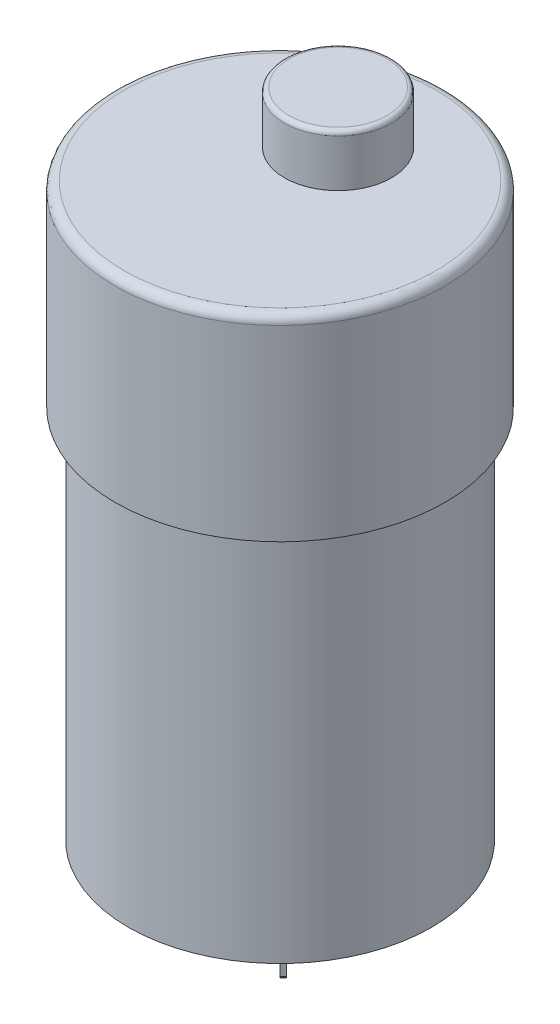
ISO-10303-21;
HEADER;
FILE_DESCRIPTION(('STEP AP214'),'2;1');
FILE_NAME('part.step','',(''),(''),'','','');
FILE_SCHEMA(('AUTOMOTIVE_DESIGN { 1 0 10303 214 1 1 1 1 }'));
ENDSEC;
DATA;
#1=APPLICATION_CONTEXT('core data for automotive mechanical design processes');
#2=APPLICATION_PROTOCOL_DEFINITION('international standard','automotive_design',2000,#1);
#3=PRODUCT_CONTEXT('',#1,'mechanical');
#4=PRODUCT('Part','Part','',(#3));
#5=PRODUCT_RELATED_PRODUCT_CATEGORY('part','',(#4));
#6=PRODUCT_DEFINITION_FORMATION('','',#4);
#7=PRODUCT_DEFINITION_CONTEXT('part definition',#1,'design');
#8=PRODUCT_DEFINITION('design','',#6,#7);
#9=PRODUCT_DEFINITION_SHAPE('','',#8);
#10=(LENGTH_UNIT() NAMED_UNIT(*) SI_UNIT(.MILLI.,.METRE.));
#11=(NAMED_UNIT(*) PLANE_ANGLE_UNIT() SI_UNIT($,.RADIAN.));
#12=(NAMED_UNIT(*) SI_UNIT($,.STERADIAN.) SOLID_ANGLE_UNIT());
#13=UNCERTAINTY_MEASURE_WITH_UNIT(LENGTH_MEASURE(1.E-05),#10,'distance_accuracy_value','');
#14=(GEOMETRIC_REPRESENTATION_CONTEXT(3) GLOBAL_UNCERTAINTY_ASSIGNED_CONTEXT((#13)) GLOBAL_UNIT_ASSIGNED_CONTEXT((#10,
#11,#12)) REPRESENTATION_CONTEXT('',''));
#15=CARTESIAN_POINT('',(0.,0.,0.));
#16=DIRECTION('',(0.,0.,1.));
#17=DIRECTION('',(1.,0.,0.));
#18=AXIS2_PLACEMENT_3D('',#15,#16,#17);
#19=CARTESIAN_POINT('',(0.,-44.5,0.));
#20=DIRECTION('',(0.,-1.,0.));
#21=DIRECTION('',(0.,0.,-1.));
#22=AXIS2_PLACEMENT_3D('',#19,#20,#21);
#23=PLANE('',#22);
#24=CARTESIAN_POINT('',(0.,-44.4999999999709,0.));
#25=DIRECTION('',(0.,1.,0.));
#26=DIRECTION('',(0.,0.,1.));
#27=AXIS2_PLACEMENT_3D('',#24,#25,#26);
#28=CIRCLE('',#27,1.99999999995271);
#29=CARTESIAN_POINT('',(0.,-44.4999999999709,1.99999999995271));
#30=VERTEX_POINT('',#29);
#31=EDGE_CURVE('E20',#30,#30,#28,.T.);
#32=ORIENTED_EDGE('',*,*,#31,.F.);
#33=EDGE_LOOP('',(#32));
#34=FACE_BOUND('',#33,.T.);
#35=ADVANCED_FACE('F17',(#34),#23,.T.);
#36=CARTESIAN_POINT('',(0.,27.8,0.));
#37=DIRECTION('',(0.,1.,0.));
#38=DIRECTION('',(0.,0.,1.));
#39=AXIS2_PLACEMENT_3D('',#36,#37,#38);
#40=PLANE('',#39);
#41=CARTESIAN_POINT('',(0.,27.8,-6.5));
#42=DIRECTION('',(0.,-1.,0.));
#43=DIRECTION('',(1.,0.,0.));
#44=AXIS2_PLACEMENT_3D('',#41,#42,#43);
#45=CIRCLE('',#44,5.5);
#46=CARTESIAN_POINT('',(5.5,27.8,-6.5));
#47=VERTEX_POINT('',#46);
#48=EDGE_CURVE('E231',#47,#47,#45,.T.);
#49=ORIENTED_EDGE('',*,*,#48,.F.);
#50=EDGE_LOOP('',(#49));
#51=FACE_BOUND('',#50,.T.);
#52=ADVANCED_FACE('F235',(#51),#40,.T.);
#53=CARTESIAN_POINT('',(0.,-43.4999999999945,0.));
#54=DIRECTION('',(0.,1.,0.));
#55=DIRECTION('',(0.,0.,1.));
#56=AXIS2_PLACEMENT_3D('',#53,#54,#55);
#57=CONICAL_SURFACE('',#56,2.9999999999859,0.78539816342587);
#58=CARTESIAN_POINT('',(0.,-43.5,0.));
#59=DIRECTION('',(0.,-1.,0.));
#60=DIRECTION('',(0.,0.,-1.));
#61=AXIS2_PLACEMENT_3D('',#58,#59,#60);
#62=CIRCLE('',#61,3.);
#63=CARTESIAN_POINT('',(0.,-43.5,-3.));
#64=VERTEX_POINT('',#63);
#65=EDGE_CURVE('E352',#64,#64,#62,.F.);
#66=ORIENTED_EDGE('',*,*,#65,.F.);
#67=EDGE_LOOP('',(#66));
#68=FACE_BOUND('',#67,.T.);
#69=ORIENTED_EDGE('',*,*,#31,.T.);
#70=EDGE_LOOP('',(#69));
#71=FACE_BOUND('',#70,.T.);
#72=ADVANCED_FACE('F219',(#68,#71),#57,.T.);
#73=CARTESIAN_POINT('',(0.,27.3,-6.5));
#74=DIRECTION('',(0.,1.,0.));
#75=DIRECTION('',(0.,0.,1.));
#76=AXIS2_PLACEMENT_3D('',#73,#74,#75);
#77=TOROIDAL_SURFACE('',#76,5.5,0.5);
#78=CARTESIAN_POINT('',(0.,27.3,-6.5));
#79=DIRECTION('',(0.,1.,0.));
#80=DIRECTION('',(0.,0.,1.));
#81=AXIS2_PLACEMENT_3D('',#78,#79,#80);
#82=CIRCLE('',#81,6.);
#83=CARTESIAN_POINT('',(0.,27.3,-0.5));
#84=VERTEX_POINT('',#83);
#85=EDGE_CURVE('E349',#84,#84,#82,.F.);
#86=ORIENTED_EDGE('',*,*,#85,.F.);
#87=EDGE_LOOP('',(#86));
#88=FACE_BOUND('',#87,.T.);
#89=ORIENTED_EDGE('',*,*,#48,.T.);
#90=EDGE_LOOP('',(#89));
#91=FACE_BOUND('',#90,.T.);
#92=ADVANCED_FACE('F213',(#88,#91),#77,.T.);
#93=CARTESIAN_POINT('',(0.,-41.,0.));
#94=DIRECTION('',(0.,-1.,0.));
#95=DIRECTION('',(0.,0.,-1.));
#96=AXIS2_PLACEMENT_3D('',#93,#94,#95);
#97=CYLINDRICAL_SURFACE('',#96,3.);
#98=CARTESIAN_POINT('',(0.,-42.,0.));
#99=DIRECTION('',(0.,-1.,0.));
#100=DIRECTION('',(0.,0.,-1.));
#101=AXIS2_PLACEMENT_3D('',#98,#99,#100);
#102=CIRCLE('',#101,3.);
#103=CARTESIAN_POINT('',(0.,-42.,-3.));
#104=VERTEX_POINT('',#103);
#105=EDGE_CURVE('E133',#104,#104,#102,.T.);
#106=ORIENTED_EDGE('',*,*,#105,.T.);
#107=EDGE_LOOP('',(#106));
#108=FACE_BOUND('',#107,.T.);
#109=ORIENTED_EDGE('',*,*,#65,.T.);
#110=EDGE_LOOP('',(#109));
#111=FACE_BOUND('',#110,.T.);
#112=ADVANCED_FACE('F209',(#108,#111),#97,.T.);
#113=CARTESIAN_POINT('',(0.,22.,-6.5));
#114=DIRECTION('',(0.,1.,0.));
#115=DIRECTION('',(0.,0.,1.));
#116=AXIS2_PLACEMENT_3D('',#113,#114,#115);
#117=CYLINDRICAL_SURFACE('',#116,6.);
#118=CARTESIAN_POINT('',(0.,22.,-6.5));
#119=DIRECTION('',(0.,1.,0.));
#120=DIRECTION('',(0.,0.,1.));
#121=AXIS2_PLACEMENT_3D('',#118,#119,#120);
#122=CIRCLE('',#121,6.);
#123=CARTESIAN_POINT('',(0.,22.,-0.5));
#124=VERTEX_POINT('',#123);
#125=EDGE_CURVE('E130',#124,#124,#122,.F.);
#126=ORIENTED_EDGE('',*,*,#125,.F.);
#127=EDGE_LOOP('',(#126));
#128=FACE_BOUND('',#127,.T.);
#129=ORIENTED_EDGE('',*,*,#85,.T.);
#130=EDGE_LOOP('',(#129));
#131=FACE_BOUND('',#130,.T.);
#132=ADVANCED_FACE('F206',(#128,#131),#117,.T.);
#133=CARTESIAN_POINT('',(9.41866232540484,-45.75,-9.77221571599806));
#134=DIRECTION('',(0.499999999999998,-0.70710678118655,-0.499999999999998));
#135=DIRECTION('',(0.,0.577350269189623,-0.816496580927728));
#136=AXIS2_PLACEMENT_3D('',#133,#134,#135);
#137=PLANE('',#136);
#138=DIRECTION('',(-0.500000000000015,-0.707106781186526,0.500000000000015));
#139=VECTOR('',#138,1.);
#140=CARTESIAN_POINT('',(9.41866232540483,-45.5,-10.1257691065914));
#141=LINE('',#140,#139);
#142=CARTESIAN_POINT('',(9.41866232540481,-45.5,-10.1257691065914));
#143=VERTEX_POINT('',#142);
#144=CARTESIAN_POINT('',(9.06510893481154,-46.,-9.77221571599808));
#145=VERTEX_POINT('',#144);
#146=EDGE_CURVE('E110',#143,#145,#141,.T.);
#147=ORIENTED_EDGE('',*,*,#146,.F.);
#148=DIRECTION('',(-0.707106781186548,0.,-0.707106781186548));
#149=VECTOR('',#148,1.);
#150=CARTESIAN_POINT('',(9.41866232540481,-45.5,-10.1257691065914));
#151=LINE('',#150,#149);
#152=CARTESIAN_POINT('',(9.77221571599809,-45.5,-9.77221571599809));
#153=VERTEX_POINT('',#152);
#154=EDGE_CURVE('E106',#153,#143,#151,.T.);
#155=ORIENTED_EDGE('',*,*,#154,.F.);
#156=DIRECTION('',(0.500000000000004,0.707106781186542,-0.500000000000004));
#157=VECTOR('',#156,1.);
#158=CARTESIAN_POINT('',(9.41866232540481,-46.,-9.41866232540481));
#159=LINE('',#158,#157);
#160=CARTESIAN_POINT('',(9.41866232540481,-46.,-9.41866232540481));
#161=VERTEX_POINT('',#160);
#162=EDGE_CURVE('E103',#161,#153,#159,.T.);
#163=ORIENTED_EDGE('',*,*,#162,.F.);
#164=DIRECTION('',(0.707106781186548,0.,0.707106781186548));
#165=VECTOR('',#164,1.);
#166=CARTESIAN_POINT('',(9.06510893481154,-46.,-9.77221571599808));
#167=LINE('',#166,#165);
#168=EDGE_CURVE('E347',#145,#161,#167,.T.);
#169=ORIENTED_EDGE('',*,*,#168,.F.);
#170=EDGE_LOOP('',(#147,#155,#163,#169));
#171=FACE_BOUND('',#170,.T.);
#172=ADVANCED_FACE('F108',(#171),#137,.T.);
#173=CARTESIAN_POINT('',(0.,-46.,0.));
#174=DIRECTION('',(0.,-1.,0.));
#175=DIRECTION('',(0.,0.,-1.));
#176=AXIS2_PLACEMENT_3D('',#173,#174,#175);
#177=PLANE('',#176);
#178=DIRECTION('',(0.707106781186547,0.,0.707106781186547));
#179=VECTOR('',#178,1.);
#180=CARTESIAN_POINT('',(8.00444876303172,-46.,-8.71155554421827));
#181=LINE('',#180,#179);
#182=CARTESIAN_POINT('',(8.00444876303172,-46.,-8.71155554421827));
#183=VERTEX_POINT('',#182);
#184=CARTESIAN_POINT('',(8.35800215362499,-46.,-8.358002153625));
#185=VERTEX_POINT('',#184);
#186=EDGE_CURVE('E344',#183,#185,#181,.T.);
#187=ORIENTED_EDGE('',*,*,#186,.F.);
#188=DIRECTION('',(-0.707106781186548,0.,0.707106781186547));
#189=VECTOR('',#188,1.);
#190=CARTESIAN_POINT('',(7.65089537243844,-46.,-8.35800215362499));
#191=LINE('',#190,#189);
#192=EDGE_CURVE('E331',#145,#183,#191,.T.);
#193=ORIENTED_EDGE('',*,*,#192,.F.);
#194=ORIENTED_EDGE('',*,*,#168,.T.);
#195=DIRECTION('',(0.707106781186548,0.,-0.707106781186548));
#196=VECTOR('',#195,1.);
#197=CARTESIAN_POINT('',(9.77221571599809,-46.,-9.77221571599809));
#198=LINE('',#197,#196);
#199=EDGE_CURVE('E129',#185,#161,#198,.T.);
#200=ORIENTED_EDGE('',*,*,#199,.F.);
#201=EDGE_LOOP('',(#187,#193,#194,#200));
#202=FACE_BOUND('',#201,.T.);
#203=ADVANCED_FACE('F199',(#202),#177,.T.);
#204=CARTESIAN_POINT('',(8.00444876303172,-45.75,-8.35800215362499));
#205=DIRECTION('',(-0.499999999999997,-0.70710678118655,0.499999999999999));
#206=DIRECTION('',(0.,-0.577350269189624,-0.816496580927727));
#207=AXIS2_PLACEMENT_3D('',#204,#205,#206);
#208=PLANE('',#207);
#209=DIRECTION('',(0.5,-0.707106781186547,-0.5));
#210=VECTOR('',#209,1.);
#211=CARTESIAN_POINT('',(8.00444876303172,-45.5,-8.00444876303172));
#212=LINE('',#211,#210);
#213=CARTESIAN_POINT('',(8.00444876303172,-45.5,-8.00444876303172));
#214=VERTEX_POINT('',#213);
#215=EDGE_CURVE('E337',#214,#185,#212,.T.);
#216=ORIENTED_EDGE('',*,*,#215,.F.);
#217=DIRECTION('',(0.707106781186548,0.,0.707106781186547));
#218=VECTOR('',#217,1.);
#219=CARTESIAN_POINT('',(8.00444876303172,-45.5,-8.00444876303172));
#220=LINE('',#219,#218);
#221=CARTESIAN_POINT('',(7.65089537243844,-45.5,-8.35800215362499));
#222=VERTEX_POINT('',#221);
#223=EDGE_CURVE('E342',#222,#214,#220,.T.);
#224=ORIENTED_EDGE('',*,*,#223,.F.);
#225=DIRECTION('',(-0.500000000000004,0.707106781186543,0.500000000000002));
#226=VECTOR('',#225,1.);
#227=CARTESIAN_POINT('',(8.00444876303172,-46.,-8.71155554421827));
#228=LINE('',#227,#226);
#229=EDGE_CURVE('E328',#183,#222,#228,.T.);
#230=ORIENTED_EDGE('',*,*,#229,.F.);
#231=ORIENTED_EDGE('',*,*,#186,.T.);
#232=EDGE_LOOP('',(#216,#224,#230,#231));
#233=FACE_BOUND('',#232,.T.);
#234=ADVANCED_FACE('F195',(#233),#208,.T.);
#235=CARTESIAN_POINT('',(8.00444876303172,-41.,-8.00444876303172));
#236=DIRECTION('',(-0.707106781186547,0.,0.707106781186548));
#237=DIRECTION('',(0.707106781186548,0.,0.707106781186547));
#238=AXIS2_PLACEMENT_3D('',#235,#236,#237);
#239=PLANE('',#238);
#240=DIRECTION('',(0.707106781186548,0.,0.707106781186547));
#241=VECTOR('',#240,1.);
#242=CARTESIAN_POINT('',(8.00444876303172,-41.,-8.00444876303172));
#243=LINE('',#242,#241);
#244=CARTESIAN_POINT('',(8.00444876303172,-41.,-8.00444876303172));
#245=VERTEX_POINT('',#244);
#246=CARTESIAN_POINT('',(7.65089537243844,-41.,-8.35800215362499));
#247=VERTEX_POINT('',#246);
#248=EDGE_CURVE('E115',#245,#247,#243,.F.);
#249=ORIENTED_EDGE('',*,*,#248,.T.);
#250=DIRECTION('',(0.,1.,0.));
#251=VECTOR('',#250,1.);
#252=CARTESIAN_POINT('',(7.65089537243844,-41.,-8.35800215362499));
#253=LINE('',#252,#251);
#254=EDGE_CURVE('E325',#222,#247,#253,.T.);
#255=ORIENTED_EDGE('',*,*,#254,.F.);
#256=ORIENTED_EDGE('',*,*,#223,.T.);
#257=DIRECTION('',(0.,1.,0.));
#258=VECTOR('',#257,1.);
#259=CARTESIAN_POINT('',(8.00444876303172,-41.,-8.00444876303172));
#260=LINE('',#259,#258);
#261=EDGE_CURVE('E123',#245,#214,#260,.F.);
#262=ORIENTED_EDGE('',*,*,#261,.F.);
#263=EDGE_LOOP('',(#249,#255,#256,#262));
#264=FACE_BOUND('',#263,.T.);
#265=ADVANCED_FACE('F192',(#264),#239,.T.);
#266=CARTESIAN_POINT('',(9.41866232540481,-41.,-10.1257691065914));
#267=DIRECTION('',(0.707106781186548,0.,-0.707106781186548));
#268=DIRECTION('',(-0.707106781186548,0.,-0.707106781186548));
#269=AXIS2_PLACEMENT_3D('',#266,#267,#268);
#270=PLANE('',#269);
#271=DIRECTION('',(-0.707106781186548,0.,-0.707106781186548));
#272=VECTOR('',#271,1.);
#273=CARTESIAN_POINT('',(9.41866232540481,-41.,-10.1257691065914));
#274=LINE('',#273,#272);
#275=CARTESIAN_POINT('',(9.41866232540482,-41.,-10.1257691065914));
#276=VERTEX_POINT('',#275);
#277=CARTESIAN_POINT('',(9.7722157159981,-41.,-9.7722157159981));
#278=VERTEX_POINT('',#277);
#279=EDGE_CURVE('E114',#276,#278,#274,.F.);
#280=ORIENTED_EDGE('',*,*,#279,.T.);
#281=DIRECTION('',(0.,1.,0.));
#282=VECTOR('',#281,1.);
#283=CARTESIAN_POINT('',(9.77221571599809,-41.,-9.77221571599809));
#284=LINE('',#283,#282);
#285=EDGE_CURVE('E118',#153,#278,#284,.T.);
#286=ORIENTED_EDGE('',*,*,#285,.F.);
#287=ORIENTED_EDGE('',*,*,#154,.T.);
#288=DIRECTION('',(0.,1.,0.));
#289=VECTOR('',#288,1.);
#290=CARTESIAN_POINT('',(9.41866232540483,-41.,-10.1257691065914));
#291=LINE('',#290,#289);
#292=EDGE_CURVE('E323',#276,#143,#291,.F.);
#293=ORIENTED_EDGE('',*,*,#292,.F.);
#294=EDGE_LOOP('',(#280,#286,#287,#293));
#295=FACE_BOUND('',#294,.T.);
#296=ADVANCED_FACE('F119',(#295),#270,.T.);
#297=CARTESIAN_POINT('',(8.53477884892163,-45.,-9.24188563010818));
#298=DIRECTION('',(-0.707106781186547,0.,-0.707106781186548));
#299=DIRECTION('',(-0.707106781186548,0.,0.707106781186547));
#300=AXIS2_PLACEMENT_3D('',#297,#298,#299);
#301=CYLINDRICAL_SURFACE('',#300,0.5);
#302=CARTESIAN_POINT('',(8.53477884892163,-45.,-9.24188563010818));
#303=DIRECTION('',(-0.707106781186547,0.,-0.707106781186548));
#304=DIRECTION('',(-0.707106781186548,0.,0.707106781186547));
#305=AXIS2_PLACEMENT_3D('',#302,#303,#304);
#306=CIRCLE('',#305,0.5);
#307=CARTESIAN_POINT('',(8.18122545832836,-45.,-8.88833223951491));
#308=VERTEX_POINT('',#307);
#309=EDGE_CURVE('E322',#308,#308,#306,.F.);
#310=ORIENTED_EDGE('',*,*,#309,.F.);
#311=EDGE_LOOP('',(#310));
#312=FACE_BOUND('',#311,.T.);
#313=CARTESIAN_POINT('',(8.88833223951491,-45.,-8.88833223951491));
#314=DIRECTION('',(-0.707106781186547,0.,-0.707106781186548));
#315=DIRECTION('',(-0.707106781186548,0.,0.707106781186547));
#316=AXIS2_PLACEMENT_3D('',#313,#314,#315);
#317=CIRCLE('',#316,0.5);
#318=CARTESIAN_POINT('',(8.53477884892163,-45.,-8.53477884892163));
#319=VERTEX_POINT('',#318);
#320=EDGE_CURVE('E335',#319,#319,#317,.T.);
#321=ORIENTED_EDGE('',*,*,#320,.F.);
#322=EDGE_LOOP('',(#321));
#323=FACE_BOUND('',#322,.T.);
#324=ADVANCED_FACE('F185',(#312,#323),#301,.F.);
#325=CARTESIAN_POINT('',(8.358002153625,-45.75,8.00444876303171));
#326=DIRECTION('',(-0.5,-0.707106781186547,-0.5));
#327=DIRECTION('',(0.,0.577350269189626,-0.816496580927726));
#328=AXIS2_PLACEMENT_3D('',#325,#326,#327);
#329=PLANE('',#328);
#330=DIRECTION('',(0.499999999999998,-0.707106781186552,0.499999999999996));
#331=VECTOR('',#330,1.);
#332=CARTESIAN_POINT('',(8.00444876303172,-45.5,8.00444876303172));
#333=LINE('',#332,#331);
#334=CARTESIAN_POINT('',(8.00444876303172,-45.5,8.00444876303172));
#335=VERTEX_POINT('',#334);
#336=CARTESIAN_POINT('',(8.35800215362499,-46.,8.35800215362499));
#337=VERTEX_POINT('',#336);
#338=EDGE_CURVE('E319',#335,#337,#333,.T.);
#339=ORIENTED_EDGE('',*,*,#338,.F.);
#340=DIRECTION('',(-0.707106781186547,0.,0.707106781186548));
#341=VECTOR('',#340,1.);
#342=CARTESIAN_POINT('',(8.00444876303172,-45.5,8.00444876303172));
#343=LINE('',#342,#341);
#344=CARTESIAN_POINT('',(8.35800215362499,-45.5,7.65089537243844));
#345=VERTEX_POINT('',#344);
#346=EDGE_CURVE('E366',#345,#335,#343,.T.);
#347=ORIENTED_EDGE('',*,*,#346,.F.);
#348=DIRECTION('',(-0.500000000000004,0.707106781186543,-0.500000000000002));
#349=VECTOR('',#348,1.);
#350=CARTESIAN_POINT('',(8.71155554421827,-46.,8.00444876303172));
#351=LINE('',#350,#349);
#352=CARTESIAN_POINT('',(8.71155554421827,-46.,8.00444876303172));
#353=VERTEX_POINT('',#352);
#354=EDGE_CURVE('E303',#353,#345,#351,.T.);
#355=ORIENTED_EDGE('',*,*,#354,.F.);
#356=DIRECTION('',(0.707106781186554,0.,-0.707106781186541));
#357=VECTOR('',#356,1.);
#358=CARTESIAN_POINT('',(8.35800215362499,-46.,8.35800215362499));
#359=LINE('',#358,#357);
#360=EDGE_CURVE('E374',#337,#353,#359,.T.);
#361=ORIENTED_EDGE('',*,*,#360,.F.);
#362=EDGE_LOOP('',(#339,#347,#355,#361));
#363=FACE_BOUND('',#362,.T.);
#364=ADVANCED_FACE('F182',(#363),#329,.T.);
#365=CARTESIAN_POINT('',(8.00444876303172,-41.,8.00444876303172));
#366=DIRECTION('',(-0.707106781186548,0.,-0.707106781186547));
#367=DIRECTION('',(-0.707106781186547,0.,0.707106781186548));
#368=AXIS2_PLACEMENT_3D('',#365,#366,#367);
#369=PLANE('',#368);
#370=DIRECTION('',(-0.707106781186547,0.,0.707106781186548));
#371=VECTOR('',#370,1.);
#372=CARTESIAN_POINT('',(8.00444876303172,-41.,8.00444876303172));
#373=LINE('',#372,#371);
#374=CARTESIAN_POINT('',(8.00444876303172,-41.,8.00444876303172));
#375=VERTEX_POINT('',#374);
#376=CARTESIAN_POINT('',(8.35800215362499,-41.,7.65089537243845));
#377=VERTEX_POINT('',#376);
#378=EDGE_CURVE('E35',#375,#377,#373,.F.);
#379=ORIENTED_EDGE('',*,*,#378,.T.);
#380=DIRECTION('',(0.,1.,0.));
#381=VECTOR('',#380,1.);
#382=CARTESIAN_POINT('',(8.35800215362499,-41.,7.65089537243844));
#383=LINE('',#382,#381);
#384=EDGE_CURVE('E301',#345,#377,#383,.T.);
#385=ORIENTED_EDGE('',*,*,#384,.F.);
#386=ORIENTED_EDGE('',*,*,#346,.T.);
#387=DIRECTION('',(0.,1.,0.));
#388=VECTOR('',#387,1.);
#389=CARTESIAN_POINT('',(8.00444876303172,-41.,8.00444876303172));
#390=LINE('',#389,#388);
#391=EDGE_CURVE('E307',#375,#335,#390,.F.);
#392=ORIENTED_EDGE('',*,*,#391,.F.);
#393=EDGE_LOOP('',(#379,#385,#386,#392));
#394=FACE_BOUND('',#393,.T.);
#395=ADVANCED_FACE('F178',(#394),#369,.T.);
#396=CARTESIAN_POINT('',(10.1257691065914,-41.,9.41866232540482));
#397=DIRECTION('',(0.707106781186548,0.,0.707106781186547));
#398=DIRECTION('',(0.707106781186547,0.,-0.707106781186548));
#399=AXIS2_PLACEMENT_3D('',#396,#397,#398);
#400=PLANE('',#399);
#401=DIRECTION('',(0.707106781186547,0.,-0.707106781186548));
#402=VECTOR('',#401,1.);
#403=CARTESIAN_POINT('',(10.1257691065914,-41.,9.41866232540482));
#404=LINE('',#403,#402);
#405=CARTESIAN_POINT('',(10.1257691065914,-41.,9.41866232540482));
#406=VERTEX_POINT('',#405);
#407=CARTESIAN_POINT('',(9.7722157159981,-41.,9.7722157159981));
#408=VERTEX_POINT('',#407);
#409=EDGE_CURVE('E370',#406,#408,#404,.F.);
#410=ORIENTED_EDGE('',*,*,#409,.T.);
#411=DIRECTION('',(0.,1.,0.));
#412=VECTOR('',#411,1.);
#413=CARTESIAN_POINT('',(9.77221571599809,-41.,9.77221571599809));
#414=LINE('',#413,#412);
#415=CARTESIAN_POINT('',(9.7722157159981,-45.5,9.7722157159981));
#416=VERTEX_POINT('',#415);
#417=EDGE_CURVE('E310',#416,#408,#414,.T.);
#418=ORIENTED_EDGE('',*,*,#417,.F.);
#419=DIRECTION('',(-0.70710678118657,0.,0.707106781186525));
#420=VECTOR('',#419,1.);
#421=CARTESIAN_POINT('',(10.1257691065914,-45.5,9.41866232540481));
#422=LINE('',#421,#420);
#423=CARTESIAN_POINT('',(10.1257691065914,-45.5,9.41866232540482));
#424=VERTEX_POINT('',#423);
#425=EDGE_CURVE('E372',#424,#416,#422,.T.);
#426=ORIENTED_EDGE('',*,*,#425,.F.);
#427=DIRECTION('',(0.,1.,0.));
#428=VECTOR('',#427,1.);
#429=CARTESIAN_POINT('',(10.1257691065914,-41.,9.41866232540483));
#430=LINE('',#429,#428);
#431=EDGE_CURVE('E298',#406,#424,#430,.F.);
#432=ORIENTED_EDGE('',*,*,#431,.F.);
#433=EDGE_LOOP('',(#410,#418,#426,#432));
#434=FACE_BOUND('',#433,.T.);
#435=ADVANCED_FACE('F174',(#434),#400,.T.);
#436=CARTESIAN_POINT('',(9.7722157159981,-45.75,9.41866232540481));
#437=DIRECTION('',(0.499999999999993,-0.707106781186558,0.499999999999993));
#438=DIRECTION('',(0.,-0.577350269189615,-0.816496580927734));
#439=AXIS2_PLACEMENT_3D('',#436,#437,#438);
#440=PLANE('',#439);
#441=DIRECTION('',(-0.500000000000022,-0.707106781186516,-0.500000000000022));
#442=VECTOR('',#441,1.);
#443=CARTESIAN_POINT('',(10.1257691065914,-45.5,9.41866232540483));
#444=LINE('',#443,#442);
#445=CARTESIAN_POINT('',(9.77221571599808,-46.,9.06510893481153));
#446=VERTEX_POINT('',#445);
#447=EDGE_CURVE('E295',#424,#446,#444,.T.);
#448=ORIENTED_EDGE('',*,*,#447,.F.);
#449=ORIENTED_EDGE('',*,*,#425,.T.);
#450=DIRECTION('',(0.499999999999996,0.707106781186552,0.499999999999996));
#451=VECTOR('',#450,1.);
#452=CARTESIAN_POINT('',(9.41866232540482,-46.,9.41866232540482));
#453=LINE('',#452,#451);
#454=CARTESIAN_POINT('',(9.41866232540482,-46.,9.41866232540482));
#455=VERTEX_POINT('',#454);
#456=EDGE_CURVE('E313',#455,#416,#453,.T.);
#457=ORIENTED_EDGE('',*,*,#456,.F.);
#458=DIRECTION('',(-0.707106781186516,0.,0.707106781186579));
#459=VECTOR('',#458,1.);
#460=CARTESIAN_POINT('',(9.77221571599808,-46.,9.06510893481153));
#461=LINE('',#460,#459);
#462=EDGE_CURVE('E377',#446,#455,#461,.T.);
#463=ORIENTED_EDGE('',*,*,#462,.F.);
#464=EDGE_LOOP('',(#448,#449,#457,#463));
#465=FACE_BOUND('',#464,.T.);
#466=ADVANCED_FACE('F170',(#465),#440,.T.);
#467=CARTESIAN_POINT('',(0.,-46.,0.));
#468=DIRECTION('',(0.,-1.,0.));
#469=DIRECTION('',(0.,0.,-1.));
#470=AXIS2_PLACEMENT_3D('',#467,#468,#469);
#471=PLANE('',#470);
#472=ORIENTED_EDGE('',*,*,#462,.T.);
#473=DIRECTION('',(0.707106781186548,0.,0.707106781186547));
#474=VECTOR('',#473,1.);
#475=CARTESIAN_POINT('',(9.77221571599809,-46.,9.77221571599809));
#476=LINE('',#475,#474);
#477=EDGE_CURVE('E316',#337,#455,#476,.T.);
#478=ORIENTED_EDGE('',*,*,#477,.F.);
#479=ORIENTED_EDGE('',*,*,#360,.T.);
#480=DIRECTION('',(-0.707106781186548,0.,-0.707106781186547));
#481=VECTOR('',#480,1.);
#482=CARTESIAN_POINT('',(8.35800215362499,-46.,7.65089537243844));
#483=LINE('',#482,#481);
#484=EDGE_CURVE('E291',#446,#353,#483,.T.);
#485=ORIENTED_EDGE('',*,*,#484,.F.);
#486=EDGE_LOOP('',(#472,#478,#479,#485));
#487=FACE_BOUND('',#486,.T.);
#488=ADVANCED_FACE('F166',(#487),#471,.T.);
#489=CARTESIAN_POINT('',(8.88833223951491,-45.,8.8883322395149));
#490=DIRECTION('',(-0.707106781186547,0.,0.707106781186548));
#491=DIRECTION('',(0.707106781186548,0.,0.707106781186547));
#492=AXIS2_PLACEMENT_3D('',#489,#490,#491);
#493=CYLINDRICAL_SURFACE('',#492,0.5);
#494=CARTESIAN_POINT('',(9.24188563010818,-45.,8.53477884892164));
#495=DIRECTION('',(-0.707106781186547,0.,0.707106781186548));
#496=DIRECTION('',(0.707106781186548,0.,0.707106781186547));
#497=AXIS2_PLACEMENT_3D('',#494,#495,#496);
#498=CIRCLE('',#497,0.5);
#499=CARTESIAN_POINT('',(9.59543902070145,-45.,8.88833223951491));
#500=VERTEX_POINT('',#499);
#501=EDGE_CURVE('E294',#500,#500,#498,.T.);
#502=ORIENTED_EDGE('',*,*,#501,.F.);
#503=EDGE_LOOP('',(#502));
#504=FACE_BOUND('',#503,.T.);
#505=CARTESIAN_POINT('',(8.88833223951491,-45.,8.88833223951491));
#506=DIRECTION('',(-0.707106781186547,0.,0.707106781186548));
#507=DIRECTION('',(0.707106781186548,0.,0.707106781186547));
#508=AXIS2_PLACEMENT_3D('',#505,#506,#507);
#509=CIRCLE('',#508,0.5);
#510=CARTESIAN_POINT('',(9.24188563010818,-45.,9.24188563010818));
#511=VERTEX_POINT('',#510);
#512=EDGE_CURVE('E306',#511,#511,#509,.F.);
#513=ORIENTED_EDGE('',*,*,#512,.F.);
#514=EDGE_LOOP('',(#513));
#515=FACE_BOUND('',#514,.T.);
#516=ADVANCED_FACE('F162',(#504,#515),#493,.F.);
#517=CARTESIAN_POINT('',(0.,-42.,0.));
#518=DIRECTION('',(0.,1.,0.));
#519=DIRECTION('',(0.,0.,1.));
#520=AXIS2_PLACEMENT_3D('',#517,#518,#519);
#521=PLANE('',#520);
#522=ORIENTED_EDGE('',*,*,#105,.F.);
#523=EDGE_LOOP('',(#522));
#524=FACE_BOUND('',#523,.T.);
#525=CARTESIAN_POINT('',(0.,-42.,0.));
#526=DIRECTION('',(0.,-1.,0.));
#527=DIRECTION('',(0.,0.,-1.));
#528=AXIS2_PLACEMENT_3D('',#525,#526,#527);
#529=CIRCLE('',#528,5.);
#530=CARTESIAN_POINT('',(0.,-42.,-5.));
#531=VERTEX_POINT('',#530);
#532=EDGE_CURVE('E399',#531,#531,#529,.F.);
#533=ORIENTED_EDGE('',*,*,#532,.F.);
#534=EDGE_LOOP('',(#533));
#535=FACE_BOUND('',#534,.T.);
#536=ADVANCED_FACE('F157',(#524,#535),#521,.F.);
#537=CARTESIAN_POINT('',(0.,22.,0.));
#538=DIRECTION('',(0.,1.,0.));
#539=DIRECTION('',(0.,0.,1.));
#540=AXIS2_PLACEMENT_3D('',#537,#538,#539);
#541=PLANE('',#540);
#542=ORIENTED_EDGE('',*,*,#125,.T.);
#543=EDGE_LOOP('',(#542));
#544=FACE_BOUND('',#543,.T.);
#545=CARTESIAN_POINT('',(0.,22.,0.));
#546=DIRECTION('',(0.,-1.,0.));
#547=DIRECTION('',(0.,0.,-1.));
#548=AXIS2_PLACEMENT_3D('',#545,#546,#547);
#549=CIRCLE('',#548,17.5);
#550=CARTESIAN_POINT('',(0.,22.,-17.5));
#551=VERTEX_POINT('',#550);
#552=EDGE_CURVE('E141',#551,#551,#549,.T.);
#553=ORIENTED_EDGE('',*,*,#552,.F.);
#554=EDGE_LOOP('',(#553));
#555=FACE_BOUND('',#554,.T.);
#556=ADVANCED_FACE('F147',(#544,#555),#541,.T.);
#557=CARTESIAN_POINT('',(9.77221571599809,-41.,-9.77221571599809));
#558=DIRECTION('',(0.707106781186548,0.,0.707106781186548));
#559=DIRECTION('',(0.707106781186548,0.,-0.707106781186548));
#560=AXIS2_PLACEMENT_3D('',#557,#558,#559);
#561=PLANE('',#560);
#562=ORIENTED_EDGE('',*,*,#320,.T.);
#563=EDGE_LOOP('',(#562));
#564=FACE_BOUND('',#563,.T.);
#565=ORIENTED_EDGE('',*,*,#215,.T.);
#566=ORIENTED_EDGE('',*,*,#199,.T.);
#567=ORIENTED_EDGE('',*,*,#162,.T.);
#568=ORIENTED_EDGE('',*,*,#285,.T.);
#569=DIRECTION('',(0.707106781186547,0.,-0.707106781186547));
#570=VECTOR('',#569,1.);
#571=CARTESIAN_POINT('',(8.00444876303172,-41.,-8.00444876303172));
#572=LINE('',#571,#570);
#573=EDGE_CURVE('E289',#245,#278,#572,.T.);
#574=ORIENTED_EDGE('',*,*,#573,.F.);
#575=ORIENTED_EDGE('',*,*,#261,.T.);
#576=EDGE_LOOP('',(#565,#566,#567,#568,#574,#575));
#577=FACE_BOUND('',#576,.T.);
#578=ADVANCED_FACE('F127',(#564,#577),#561,.T.);
#579=CARTESIAN_POINT('',(7.65089537243844,-41.,-8.35800215362499));
#580=DIRECTION('',(-0.707106781186547,0.,-0.707106781186548));
#581=DIRECTION('',(-0.707106781186548,0.,0.707106781186547));
#582=AXIS2_PLACEMENT_3D('',#579,#580,#581);
#583=PLANE('',#582);
#584=ORIENTED_EDGE('',*,*,#309,.T.);
#585=EDGE_LOOP('',(#584));
#586=FACE_BOUND('',#585,.T.);
#587=DIRECTION('',(-0.70710678118654,0.,0.707106781186556));
#588=VECTOR('',#587,1.);
#589=CARTESIAN_POINT('',(9.41866232540481,-41.,-10.1257691065914));
#590=LINE('',#589,#588);
#591=EDGE_CURVE('E438',#276,#247,#590,.T.);
#592=ORIENTED_EDGE('',*,*,#591,.F.);
#593=ORIENTED_EDGE('',*,*,#292,.T.);
#594=ORIENTED_EDGE('',*,*,#146,.T.);
#595=ORIENTED_EDGE('',*,*,#192,.T.);
#596=ORIENTED_EDGE('',*,*,#229,.T.);
#597=ORIENTED_EDGE('',*,*,#254,.T.);
#598=EDGE_LOOP('',(#592,#593,#594,#595,#596,#597));
#599=FACE_BOUND('',#598,.T.);
#600=ADVANCED_FACE('F445',(#586,#599),#583,.T.);
#601=CARTESIAN_POINT('',(9.77221571599809,-41.,9.77221571599809));
#602=DIRECTION('',(-0.707106781186547,0.,0.707106781186548));
#603=DIRECTION('',(0.707106781186548,0.,0.707106781186547));
#604=AXIS2_PLACEMENT_3D('',#601,#602,#603);
#605=PLANE('',#604);
#606=ORIENTED_EDGE('',*,*,#512,.T.);
#607=EDGE_LOOP('',(#606));
#608=FACE_BOUND('',#607,.T.);
#609=DIRECTION('',(0.707106781186547,0.,0.707106781186547));
#610=VECTOR('',#609,1.);
#611=CARTESIAN_POINT('',(8.00444876303172,-41.,8.00444876303172));
#612=LINE('',#611,#610);
#613=EDGE_CURVE('E436',#375,#408,#612,.T.);
#614=ORIENTED_EDGE('',*,*,#613,.F.);
#615=ORIENTED_EDGE('',*,*,#391,.T.);
#616=ORIENTED_EDGE('',*,*,#338,.T.);
#617=ORIENTED_EDGE('',*,*,#477,.T.);
#618=ORIENTED_EDGE('',*,*,#456,.T.);
#619=ORIENTED_EDGE('',*,*,#417,.T.);
#620=EDGE_LOOP('',(#614,#615,#616,#617,#618,#619));
#621=FACE_BOUND('',#620,.T.);
#622=ADVANCED_FACE('F447',(#608,#621),#605,.T.);
#623=CARTESIAN_POINT('',(8.35800215362499,-41.,7.65089537243844));
#624=DIRECTION('',(0.707106781186547,0.,-0.707106781186548));
#625=DIRECTION('',(-0.707106781186548,0.,-0.707106781186547));
#626=AXIS2_PLACEMENT_3D('',#623,#624,#625);
#627=PLANE('',#626);
#628=ORIENTED_EDGE('',*,*,#501,.T.);
#629=EDGE_LOOP('',(#628));
#630=FACE_BOUND('',#629,.T.);
#631=ORIENTED_EDGE('',*,*,#447,.T.);
#632=ORIENTED_EDGE('',*,*,#484,.T.);
#633=ORIENTED_EDGE('',*,*,#354,.T.);
#634=ORIENTED_EDGE('',*,*,#384,.T.);
#635=DIRECTION('',(-0.707106781186555,0.,-0.70710678118654));
#636=VECTOR('',#635,1.);
#637=CARTESIAN_POINT('',(10.1257691065914,-41.,9.41866232540482));
#638=LINE('',#637,#636);
#639=EDGE_CURVE('E406',#406,#377,#638,.T.);
#640=ORIENTED_EDGE('',*,*,#639,.F.);
#641=ORIENTED_EDGE('',*,*,#431,.T.);
#642=EDGE_LOOP('',(#631,#632,#633,#634,#640,#641));
#643=FACE_BOUND('',#642,.T.);
#644=ADVANCED_FACE('F453',(#630,#643),#627,.T.);
#645=CARTESIAN_POINT('',(0.,-42.,0.));
#646=DIRECTION('',(0.,-1.,0.));
#647=DIRECTION('',(0.,0.,-1.));
#648=AXIS2_PLACEMENT_3D('',#645,#646,#647);
#649=CYLINDRICAL_SURFACE('',#648,5.);
#650=CARTESIAN_POINT('',(0.,-41.,0.));
#651=DIRECTION('',(0.,-1.,0.));
#652=DIRECTION('',(0.,0.,-1.));
#653=AXIS2_PLACEMENT_3D('',#650,#651,#652);
#654=CIRCLE('',#653,5.);
#655=CARTESIAN_POINT('',(0.,-41.,-5.));
#656=VERTEX_POINT('',#655);
#657=EDGE_CURVE('E402',#656,#656,#654,.F.);
#658=ORIENTED_EDGE('',*,*,#657,.F.);
#659=EDGE_LOOP('',(#658));
#660=FACE_BOUND('',#659,.T.);
#661=ORIENTED_EDGE('',*,*,#532,.T.);
#662=EDGE_LOOP('',(#661));
#663=FACE_BOUND('',#662,.T.);
#664=ADVANCED_FACE('F283',(#660,#663),#649,.T.);
#665=CARTESIAN_POINT('',(0.,21.,0.));
#666=DIRECTION('',(0.,1.,0.));
#667=DIRECTION('',(0.,0.,1.));
#668=AXIS2_PLACEMENT_3D('',#665,#666,#667);
#669=TOROIDAL_SURFACE('',#668,17.5,1.);
#670=CARTESIAN_POINT('',(0.,21.,0.));
#671=DIRECTION('',(0.,1.,0.));
#672=DIRECTION('',(0.,0.,1.));
#673=AXIS2_PLACEMENT_3D('',#670,#671,#672);
#674=CIRCLE('',#673,18.5);
#675=CARTESIAN_POINT('',(0.,21.,18.5));
#676=VERTEX_POINT('',#675);
#677=EDGE_CURVE('E405',#676,#676,#674,.F.);
#678=ORIENTED_EDGE('',*,*,#677,.F.);
#679=EDGE_LOOP('',(#678));
#680=FACE_BOUND('',#679,.T.);
#681=ORIENTED_EDGE('',*,*,#552,.T.);
#682=EDGE_LOOP('',(#681));
#683=FACE_BOUND('',#682,.T.);
#684=ADVANCED_FACE('F277',(#680,#683),#669,.T.);
#685=CARTESIAN_POINT('',(0.,-41.,0.));
#686=DIRECTION('',(0.,-1.,0.));
#687=DIRECTION('',(0.,0.,-1.));
#688=AXIS2_PLACEMENT_3D('',#685,#686,#687);
#689=PLANE('',#688);
#690=ORIENTED_EDGE('',*,*,#657,.T.);
#691=EDGE_LOOP('',(#690));
#692=FACE_BOUND('',#691,.T.);
#693=ORIENTED_EDGE('',*,*,#639,.T.);
#694=ORIENTED_EDGE('',*,*,#378,.F.);
#695=ORIENTED_EDGE('',*,*,#613,.T.);
#696=ORIENTED_EDGE('',*,*,#409,.F.);
#697=EDGE_LOOP('',(#693,#694,#695,#696));
#698=FACE_BOUND('',#697,.T.);
#699=ORIENTED_EDGE('',*,*,#591,.T.);
#700=ORIENTED_EDGE('',*,*,#248,.F.);
#701=ORIENTED_EDGE('',*,*,#573,.T.);
#702=ORIENTED_EDGE('',*,*,#279,.F.);
#703=EDGE_LOOP('',(#699,#700,#701,#702));
#704=FACE_BOUND('',#703,.T.);
#705=CARTESIAN_POINT('',(0.,-41.,0.));
#706=DIRECTION('',(0.,-1.,0.));
#707=DIRECTION('',(0.,0.,-1.));
#708=AXIS2_PLACEMENT_3D('',#705,#706,#707);
#709=CIRCLE('',#708,16.5);
#710=CARTESIAN_POINT('',(0.,-41.,-16.5));
#711=VERTEX_POINT('',#710);
#712=EDGE_CURVE('E407',#711,#711,#709,.T.);
#713=ORIENTED_EDGE('',*,*,#712,.T.);
#714=EDGE_LOOP('',(#713));
#715=FACE_BOUND('',#714,.T.);
#716=ADVANCED_FACE('F273',(#692,#698,#704,#715),#689,.T.);
#717=CARTESIAN_POINT('',(0.,0.,0.));
#718=DIRECTION('',(0.,1.,0.));
#719=DIRECTION('',(0.,0.,1.));
#720=AXIS2_PLACEMENT_3D('',#717,#718,#719);
#721=CYLINDRICAL_SURFACE('',#720,18.5);
#722=CARTESIAN_POINT('',(0.,0.,0.));
#723=DIRECTION('',(0.,1.,0.));
#724=DIRECTION('',(0.,0.,1.));
#725=AXIS2_PLACEMENT_3D('',#722,#723,#724);
#726=CIRCLE('',#725,18.5);
#727=CARTESIAN_POINT('',(0.,0.,18.5));
#728=VERTEX_POINT('',#727);
#729=EDGE_CURVE('E410',#728,#728,#726,.T.);
#730=ORIENTED_EDGE('',*,*,#729,.T.);
#731=EDGE_LOOP('',(#730));
#732=FACE_BOUND('',#731,.T.);
#733=ORIENTED_EDGE('',*,*,#677,.T.);
#734=EDGE_LOOP('',(#733));
#735=FACE_BOUND('',#734,.T.);
#736=ADVANCED_FACE('F269',(#732,#735),#721,.T.);
#737=CARTESIAN_POINT('',(0.,-42.,0.));
#738=DIRECTION('',(0.,-1.,0.));
#739=DIRECTION('',(0.,0.,-1.));
#740=AXIS2_PLACEMENT_3D('',#737,#738,#739);
#741=CYLINDRICAL_SURFACE('',#740,16.5);
#742=ORIENTED_EDGE('',*,*,#712,.F.);
#743=EDGE_LOOP('',(#742));
#744=FACE_BOUND('',#743,.T.);
#745=CARTESIAN_POINT('',(0.,-42.,0.));
#746=DIRECTION('',(0.,-1.,0.));
#747=DIRECTION('',(0.,0.,-1.));
#748=AXIS2_PLACEMENT_3D('',#745,#746,#747);
#749=CIRCLE('',#748,16.5);
#750=CARTESIAN_POINT('',(0.,-42.,-16.5));
#751=VERTEX_POINT('',#750);
#752=EDGE_CURVE('E413',#751,#751,#749,.T.);
#753=ORIENTED_EDGE('',*,*,#752,.T.);
#754=EDGE_LOOP('',(#753));
#755=FACE_BOUND('',#754,.T.);
#756=ADVANCED_FACE('F265',(#744,#755),#741,.F.);
#757=CARTESIAN_POINT('',(0.,0.,0.));
#758=DIRECTION('',(0.,1.,0.));
#759=DIRECTION('',(0.,0.,1.));
#760=AXIS2_PLACEMENT_3D('',#757,#758,#759);
#761=PLANE('',#760);
#762=CARTESIAN_POINT('',(0.,0.,0.));
#763=DIRECTION('',(0.,1.,0.));
#764=DIRECTION('',(0.,0.,1.));
#765=AXIS2_PLACEMENT_3D('',#762,#763,#764);
#766=CIRCLE('',#765,17.);
#767=CARTESIAN_POINT('',(0.,0.,17.));
#768=VERTEX_POINT('',#767);
#769=EDGE_CURVE('E26',#768,#768,#766,.F.);
#770=ORIENTED_EDGE('',*,*,#769,.F.);
#771=EDGE_LOOP('',(#770));
#772=FACE_BOUND('',#771,.T.);
#773=ORIENTED_EDGE('',*,*,#729,.F.);
#774=EDGE_LOOP('',(#773));
#775=FACE_BOUND('',#774,.T.);
#776=ADVANCED_FACE('F258',(#772,#775),#761,.F.);
#777=CARTESIAN_POINT('',(0.,-42.,0.));
#778=DIRECTION('',(0.,1.,0.));
#779=DIRECTION('',(0.,0.,1.));
#780=AXIS2_PLACEMENT_3D('',#777,#778,#779);
#781=PLANE('',#780);
#782=ORIENTED_EDGE('',*,*,#752,.F.);
#783=EDGE_LOOP('',(#782));
#784=FACE_BOUND('',#783,.T.);
#785=CARTESIAN_POINT('',(0.,-42.,0.));
#786=DIRECTION('',(0.,1.,0.));
#787=DIRECTION('',(0.,0.,1.));
#788=AXIS2_PLACEMENT_3D('',#785,#786,#787);
#789=CIRCLE('',#788,17.);
#790=CARTESIAN_POINT('',(0.,-42.,17.));
#791=VERTEX_POINT('',#790);
#792=EDGE_CURVE('E11',#791,#791,#789,.T.);
#793=ORIENTED_EDGE('',*,*,#792,.F.);
#794=EDGE_LOOP('',(#793));
#795=FACE_BOUND('',#794,.T.);
#796=ADVANCED_FACE('F252',(#784,#795),#781,.F.);
#797=CARTESIAN_POINT('',(0.,0.,0.));
#798=DIRECTION('',(0.,1.,0.));
#799=DIRECTION('',(0.,0.,1.));
#800=AXIS2_PLACEMENT_3D('',#797,#798,#799);
#801=CYLINDRICAL_SURFACE('',#800,17.);
#802=ORIENTED_EDGE('',*,*,#792,.T.);
#803=EDGE_LOOP('',(#802));
#804=FACE_BOUND('',#803,.T.);
#805=ORIENTED_EDGE('',*,*,#769,.T.);
#806=EDGE_LOOP('',(#805));
#807=FACE_BOUND('',#806,.T.);
#808=ADVANCED_FACE('F250',(#804,#807),#801,.T.);
#809=CLOSED_SHELL('',(#35,#52,#72,#92,#112,#132,#172,#203,#234,#265,#296,#324,#364,#395,#435,
#466,#488,#516,#536,#556,#578,#600,#622,#644,#664,#684,#716,#736,#756,#776,#796,#808));
#810=MANIFOLD_SOLID_BREP('B1',#809);
#811=ADVANCED_BREP_SHAPE_REPRESENTATION('',(#18,#810),#14);
#812=SHAPE_DEFINITION_REPRESENTATION(#9,#811);
ENDSEC;
END-ISO-10303-21;
